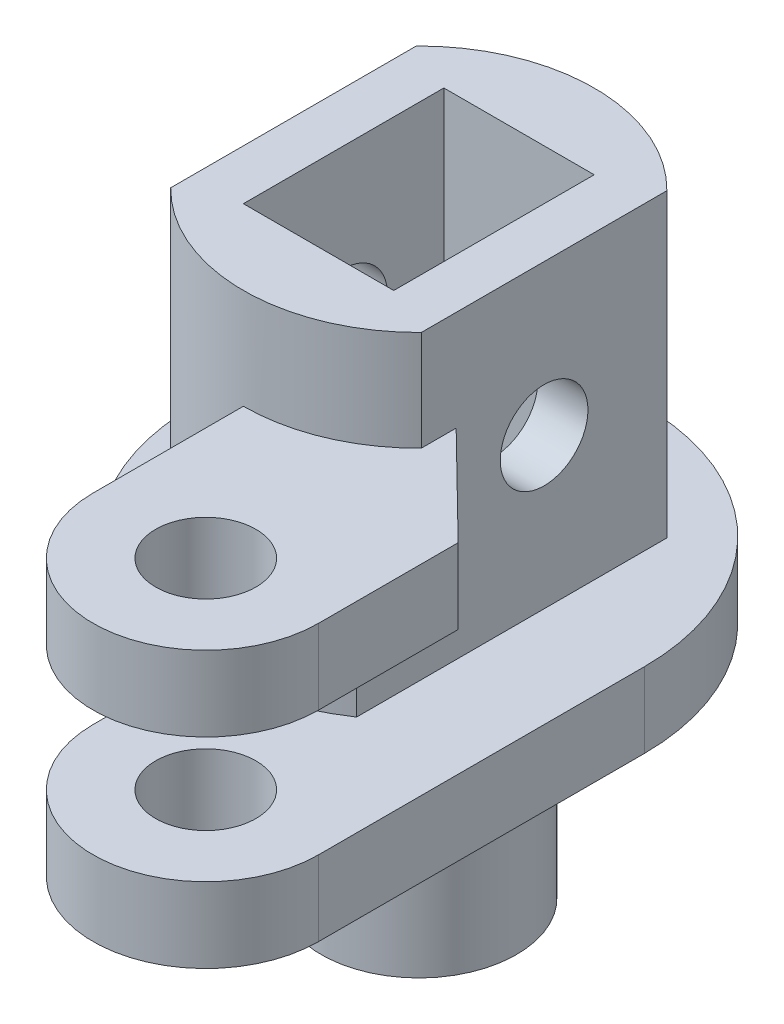
ISO-10303-21;
HEADER;
FILE_DESCRIPTION(('STEP AP214'),'2;1');
FILE_NAME('part.step','',(''),(''),'','','');
FILE_SCHEMA(('AUTOMOTIVE_DESIGN { 1 0 10303 214 1 1 1 1 }'));
ENDSEC;
DATA;
#1=APPLICATION_CONTEXT('core data for automotive mechanical design processes');
#2=APPLICATION_PROTOCOL_DEFINITION('international standard','automotive_design',2000,#1);
#3=PRODUCT_CONTEXT('',#1,'mechanical');
#4=PRODUCT('Part','Part','',(#3));
#5=PRODUCT_RELATED_PRODUCT_CATEGORY('part','',(#4));
#6=PRODUCT_DEFINITION_FORMATION('','',#4);
#7=PRODUCT_DEFINITION_CONTEXT('part definition',#1,'design');
#8=PRODUCT_DEFINITION('design','',#6,#7);
#9=PRODUCT_DEFINITION_SHAPE('','',#8);
#10=(LENGTH_UNIT() NAMED_UNIT(*) SI_UNIT(.MILLI.,.METRE.));
#11=(NAMED_UNIT(*) PLANE_ANGLE_UNIT() SI_UNIT($,.RADIAN.));
#12=(NAMED_UNIT(*) SI_UNIT($,.STERADIAN.) SOLID_ANGLE_UNIT());
#13=UNCERTAINTY_MEASURE_WITH_UNIT(LENGTH_MEASURE(1.E-05),#10,'distance_accuracy_value','');
#14=(GEOMETRIC_REPRESENTATION_CONTEXT(3) GLOBAL_UNCERTAINTY_ASSIGNED_CONTEXT((#13)) GLOBAL_UNIT_ASSIGNED_CONTEXT((#10,
#11,#12)) REPRESENTATION_CONTEXT('',''));
#15=CARTESIAN_POINT('',(0.,0.,0.));
#16=DIRECTION('',(0.,0.,1.));
#17=DIRECTION('',(1.,0.,0.));
#18=AXIS2_PLACEMENT_3D('',#15,#16,#17);
#19=CARTESIAN_POINT('',(0.,15.,0.));
#20=DIRECTION('',(0.,1.,0.));
#21=DIRECTION('',(0.,0.,1.));
#22=AXIS2_PLACEMENT_3D('',#19,#20,#21);
#23=PLANE('',#22);
#24=DIRECTION('',(-1.,0.,0.));
#25=VECTOR('',#24,1.);
#26=CARTESIAN_POINT('',(-3.,15.,-4.));
#27=LINE('',#26,#25);
#28=CARTESIAN_POINT('',(3.,15.,-4.));
#29=VERTEX_POINT('',#28);
#30=CARTESIAN_POINT('',(-3.,15.,-4.));
#31=VERTEX_POINT('',#30);
#32=EDGE_CURVE('E375',#29,#31,#27,.T.);
#33=ORIENTED_EDGE('',*,*,#32,.F.);
#34=DIRECTION('',(0.,0.,-1.));
#35=VECTOR('',#34,1.);
#36=CARTESIAN_POINT('',(3.,15.,-4.));
#37=LINE('',#36,#35);
#38=CARTESIAN_POINT('',(3.,15.,4.));
#39=VERTEX_POINT('',#38);
#40=EDGE_CURVE('E366',#39,#29,#37,.T.);
#41=ORIENTED_EDGE('',*,*,#40,.F.);
#42=DIRECTION('',(1.,0.,0.));
#43=VECTOR('',#42,1.);
#44=CARTESIAN_POINT('',(-3.,15.,4.));
#45=LINE('',#44,#43);
#46=CARTESIAN_POINT('',(-3.,15.,4.));
#47=VERTEX_POINT('',#46);
#48=EDGE_CURVE('E367',#47,#39,#45,.T.);
#49=ORIENTED_EDGE('',*,*,#48,.F.);
#50=DIRECTION('',(0.,0.,1.));
#51=VECTOR('',#50,1.);
#52=CARTESIAN_POINT('',(-3.,15.,-4.));
#53=LINE('',#52,#51);
#54=EDGE_CURVE('E371',#31,#47,#53,.T.);
#55=ORIENTED_EDGE('',*,*,#54,.F.);
#56=EDGE_LOOP('',(#33,#41,#49,#55));
#57=FACE_BOUND('',#56,.T.);
#58=CARTESIAN_POINT('',(0.,15.,0.));
#59=DIRECTION('',(0.,-1.,0.));
#60=DIRECTION('',(0.,0.,1.));
#61=AXIS2_PLACEMENT_3D('',#58,#59,#60);
#62=CIRCLE('',#61,7.);
#63=CARTESIAN_POINT('',(5.,15.,4.89897948556635));
#64=VERTEX_POINT('',#63);
#65=CARTESIAN_POINT('',(-5.00000000000003,15.,4.89897948556632));
#66=VERTEX_POINT('',#65);
#67=EDGE_CURVE('E411',#64,#66,#62,.T.);
#68=ORIENTED_EDGE('',*,*,#67,.F.);
#69=DIRECTION('',(0.,0.,1.));
#70=VECTOR('',#69,1.);
#71=CARTESIAN_POINT('',(5.,15.,9.));
#72=LINE('',#71,#70);
#73=CARTESIAN_POINT('',(5.,15.,-4.89897948556636));
#74=VERTEX_POINT('',#73);
#75=EDGE_CURVE('E195',#74,#64,#72,.T.);
#76=ORIENTED_EDGE('',*,*,#75,.F.);
#77=CARTESIAN_POINT('',(-4.99999999999997,15.,-4.89897948556639));
#78=VERTEX_POINT('',#77);
#79=EDGE_CURVE('E410',#78,#74,#62,.T.);
#80=ORIENTED_EDGE('',*,*,#79,.F.);
#81=DIRECTION('',(0.,0.,-1.));
#82=VECTOR('',#81,1.);
#83=CARTESIAN_POINT('',(-4.99999999999995,15.,-7.50000000000004));
#84=LINE('',#83,#82);
#85=EDGE_CURVE('E70',#66,#78,#84,.T.);
#86=ORIENTED_EDGE('',*,*,#85,.F.);
#87=EDGE_LOOP('',(#68,#76,#80,#86));
#88=FACE_BOUND('',#87,.T.);
#89=ADVANCED_FACE('F45',(#57,#88),#23,.T.);
#90=CARTESIAN_POINT('',(5.,0.,0.));
#91=DIRECTION('',(1.,0.,0.));
#92=DIRECTION('',(0.,0.,-1.));
#93=AXIS2_PLACEMENT_3D('',#90,#91,#92);
#94=PLANE('',#93);
#95=CARTESIAN_POINT('',(5.,9.,0.));
#96=DIRECTION('',(1.,0.,0.));
#97=DIRECTION('',(0.,0.,-1.));
#98=AXIS2_PLACEMENT_3D('',#95,#96,#97);
#99=CIRCLE('',#98,1.75);
#100=CARTESIAN_POINT('',(5.,9.,-1.74999999999997));
#101=VERTEX_POINT('',#100);
#102=EDGE_CURVE('E186',#101,#101,#99,.T.);
#103=ORIENTED_EDGE('',*,*,#102,.F.);
#104=EDGE_LOOP('',(#103));
#105=FACE_BOUND('',#104,.T.);
#106=ORIENTED_EDGE('',*,*,#75,.T.);
#107=DIRECTION('',(0.,1.,0.));
#108=VECTOR('',#107,1.);
#109=CARTESIAN_POINT('',(5.,-14.4558441227157,4.89897948556635));
#110=LINE('',#109,#108);
#111=CARTESIAN_POINT('',(5.,11.,4.89897948556635));
#112=VERTEX_POINT('',#111);
#113=EDGE_CURVE('E180',#64,#112,#110,.F.);
#114=ORIENTED_EDGE('',*,*,#113,.T.);
#115=DIRECTION('',(0.,0.,1.));
#116=VECTOR('',#115,1.);
#117=CARTESIAN_POINT('',(5.,11.,3.50923953039614));
#118=LINE('',#117,#116);
#119=CARTESIAN_POINT('',(5.,11.,3.50923953039614));
#120=VERTEX_POINT('',#119);
#121=EDGE_CURVE('E192',#120,#112,#118,.T.);
#122=ORIENTED_EDGE('',*,*,#121,.F.);
#123=DIRECTION('',(0.,-1.,0.));
#124=VECTOR('',#123,1.);
#125=CARTESIAN_POINT('',(5.,11.,3.50923953039614));
#126=LINE('',#125,#124);
#127=CARTESIAN_POINT('',(5.,8.,3.50923953039614));
#128=VERTEX_POINT('',#127);
#129=EDGE_CURVE('E250',#120,#128,#126,.T.);
#130=ORIENTED_EDGE('',*,*,#129,.T.);
#131=DIRECTION('',(0.,0.,1.));
#132=VECTOR('',#131,1.);
#133=CARTESIAN_POINT('',(5.,8.,3.50923953039614));
#134=LINE('',#133,#132);
#135=CARTESIAN_POINT('',(5.,8.,7.48331477354788));
#136=VERTEX_POINT('',#135);
#137=EDGE_CURVE('E222',#128,#136,#134,.T.);
#138=ORIENTED_EDGE('',*,*,#137,.T.);
#139=DIRECTION('',(0.,-1.,0.));
#140=VECTOR('',#139,1.);
#141=CARTESIAN_POINT('',(5.,15.,7.48331477354788));
#142=LINE('',#141,#140);
#143=CARTESIAN_POINT('',(5.,3.,7.48331477354788));
#144=VERTEX_POINT('',#143);
#145=EDGE_CURVE('E259',#136,#144,#142,.T.);
#146=ORIENTED_EDGE('',*,*,#145,.T.);
#147=DIRECTION('',(0.,0.,-1.));
#148=VECTOR('',#147,1.);
#149=CARTESIAN_POINT('',(5.,3.,9.));
#150=LINE('',#149,#148);
#151=CARTESIAN_POINT('',(5.,3.,-4.89897948556636));
#152=VERTEX_POINT('',#151);
#153=EDGE_CURVE('E253',#144,#152,#150,.T.);
#154=ORIENTED_EDGE('',*,*,#153,.T.);
#155=DIRECTION('',(0.,1.,0.));
#156=VECTOR('',#155,1.);
#157=CARTESIAN_POINT('',(5.,-22.4558441227157,-4.89897948556636));
#158=LINE('',#157,#156);
#159=EDGE_CURVE('E419',#74,#152,#158,.F.);
#160=ORIENTED_EDGE('',*,*,#159,.F.);
#161=EDGE_LOOP('',(#106,#114,#122,#130,#138,#146,#154,#160));
#162=FACE_BOUND('',#161,.T.);
#163=ADVANCED_FACE('F190',(#105,#162),#94,.T.);
#164=CARTESIAN_POINT('',(0.,11.,13.));
#165=DIRECTION('',(1.,0.,0.));
#166=DIRECTION('',(0.,0.,-1.));
#167=AXIS2_PLACEMENT_3D('',#164,#165,#166);
#168=PLANE('',#167);
#169=DIRECTION('',(0.,0.,1.));
#170=VECTOR('',#169,1.);
#171=CARTESIAN_POINT('',(0.,11.,13.));
#172=LINE('',#171,#170);
#173=CARTESIAN_POINT('',(0.,11.,7.));
#174=VERTEX_POINT('',#173);
#175=CARTESIAN_POINT('',(0.,11.,13.));
#176=VERTEX_POINT('',#175);
#177=EDGE_CURVE('E63',#174,#176,#172,.T.);
#178=ORIENTED_EDGE('',*,*,#177,.F.);
#179=DIRECTION('',(0.,1.,0.));
#180=VECTOR('',#179,1.);
#181=CARTESIAN_POINT('',(0.,-22.4558441227157,7.));
#182=LINE('',#181,#180);
#183=CARTESIAN_POINT('',(0.,3.,7.));
#184=VERTEX_POINT('',#183);
#185=EDGE_CURVE('E182',#184,#174,#182,.T.);
#186=ORIENTED_EDGE('',*,*,#185,.F.);
#187=DIRECTION('',(0.,0.,-1.));
#188=VECTOR('',#187,1.);
#189=CARTESIAN_POINT('',(0.,3.,7.));
#190=LINE('',#189,#188);
#191=CARTESIAN_POINT('',(0.,3.,9.));
#192=VERTEX_POINT('',#191);
#193=EDGE_CURVE('E421',#192,#184,#190,.T.);
#194=ORIENTED_EDGE('',*,*,#193,.F.);
#195=DIRECTION('',(0.,1.,0.));
#196=VECTOR('',#195,1.);
#197=CARTESIAN_POINT('',(0.,-22.4558441227157,9.));
#198=LINE('',#197,#196);
#199=CARTESIAN_POINT('',(0.,8.,9.));
#200=VERTEX_POINT('',#199);
#201=EDGE_CURVE('E414',#192,#200,#198,.T.);
#202=ORIENTED_EDGE('',*,*,#201,.T.);
#203=DIRECTION('',(0.,0.,1.));
#204=VECTOR('',#203,1.);
#205=CARTESIAN_POINT('',(0.,8.,13.));
#206=LINE('',#205,#204);
#207=CARTESIAN_POINT('',(0.,8.,13.));
#208=VERTEX_POINT('',#207);
#209=EDGE_CURVE('E231',#200,#208,#206,.T.);
#210=ORIENTED_EDGE('',*,*,#209,.T.);
#211=DIRECTION('',(0.,-1.,0.));
#212=VECTOR('',#211,1.);
#213=CARTESIAN_POINT('',(0.,11.,13.));
#214=LINE('',#213,#212);
#215=EDGE_CURVE('E246',#176,#208,#214,.T.);
#216=ORIENTED_EDGE('',*,*,#215,.F.);
#217=EDGE_LOOP('',(#178,#186,#194,#202,#210,#216));
#218=FACE_BOUND('',#217,.T.);
#219=ADVANCED_FACE('F463',(#218),#168,.F.);
#220=CARTESIAN_POINT('',(0.,-22.4558441227157,0.));
#221=DIRECTION('',(0.,1.,0.));
#222=DIRECTION('',(0.,0.,1.));
#223=AXIS2_PLACEMENT_3D('',#220,#221,#222);
#224=CYLINDRICAL_SURFACE('',#223,7.);
#225=ORIENTED_EDGE('',*,*,#67,.T.);
#226=DIRECTION('',(0.,1.,0.));
#227=VECTOR('',#226,1.);
#228=CARTESIAN_POINT('',(-5.00000000000003,-22.4558441227157,4.89897948556632));
#229=LINE('',#228,#227);
#230=CARTESIAN_POINT('',(-5.00000000000003,3.,4.89897948556632));
#231=VERTEX_POINT('',#230);
#232=EDGE_CURVE('E11',#231,#66,#229,.T.);
#233=ORIENTED_EDGE('',*,*,#232,.F.);
#234=CARTESIAN_POINT('',(0.,3.,0.));
#235=DIRECTION('',(0.,-1.,0.));
#236=DIRECTION('',(0.,0.,-1.));
#237=AXIS2_PLACEMENT_3D('',#234,#235,#236);
#238=CIRCLE('',#237,7.);
#239=EDGE_CURVE('E415',#184,#231,#238,.T.);
#240=ORIENTED_EDGE('',*,*,#239,.F.);
#241=ORIENTED_EDGE('',*,*,#185,.T.);
#242=CARTESIAN_POINT('',(0.,11.,0.));
#243=DIRECTION('',(0.,1.,0.));
#244=DIRECTION('',(0.,0.,1.));
#245=AXIS2_PLACEMENT_3D('',#242,#243,#244);
#246=CIRCLE('',#245,7.);
#247=EDGE_CURVE('E176',#112,#174,#246,.F.);
#248=ORIENTED_EDGE('',*,*,#247,.F.);
#249=ORIENTED_EDGE('',*,*,#113,.F.);
#250=EDGE_LOOP('',(#225,#233,#240,#241,#248,#249));
#251=FACE_BOUND('',#250,.T.);
#252=ADVANCED_FACE('F179',(#251),#224,.T.);
#253=ORIENTED_EDGE('',*,*,#159,.T.);
#254=CARTESIAN_POINT('',(-4.99999999999997,3.,-4.89897948556639));
#255=VERTEX_POINT('',#254);
#256=EDGE_CURVE('E420',#255,#152,#238,.T.);
#257=ORIENTED_EDGE('',*,*,#256,.F.);
#258=DIRECTION('',(0.,1.,0.));
#259=VECTOR('',#258,1.);
#260=CARTESIAN_POINT('',(-4.99999999999997,-22.4558441227157,-4.89897948556639));
#261=LINE('',#260,#259);
#262=EDGE_CURVE('E55',#78,#255,#261,.F.);
#263=ORIENTED_EDGE('',*,*,#262,.F.);
#264=ORIENTED_EDGE('',*,*,#79,.T.);
#265=EDGE_LOOP('',(#253,#257,#263,#264));
#266=FACE_BOUND('',#265,.T.);
#267=ADVANCED_FACE('F592',(#266),#224,.T.);
#268=CARTESIAN_POINT('',(0.,15.,0.));
#269=DIRECTION('',(0.,-1.,0.));
#270=DIRECTION('',(0.,0.,-1.));
#271=AXIS2_PLACEMENT_3D('',#268,#269,#270);
#272=CYLINDRICAL_SURFACE('',#271,9.);
#273=DIRECTION('',(0.,-1.,0.));
#274=VECTOR('',#273,1.);
#275=CARTESIAN_POINT('',(0.,3.,9.));
#276=LINE('',#275,#274);
#277=CARTESIAN_POINT('',(0.,0.,9.));
#278=VERTEX_POINT('',#277);
#279=EDGE_CURVE('E301',#192,#278,#276,.T.);
#280=ORIENTED_EDGE('',*,*,#279,.F.);
#281=CARTESIAN_POINT('',(0.,3.,0.));
#282=DIRECTION('',(0.,1.,0.));
#283=DIRECTION('',(0.,0.,1.));
#284=AXIS2_PLACEMENT_3D('',#281,#282,#283);
#285=CIRCLE('',#284,9.);
#286=CARTESIAN_POINT('',(9.,3.,0.));
#287=VERTEX_POINT('',#286);
#288=EDGE_CURVE('E262',#287,#192,#285,.T.);
#289=ORIENTED_EDGE('',*,*,#288,.F.);
#290=DIRECTION('',(0.,-1.,0.));
#291=VECTOR('',#290,1.);
#292=CARTESIAN_POINT('',(9.,3.,0.));
#293=LINE('',#292,#291);
#294=CARTESIAN_POINT('',(9.,0.,0.));
#295=VERTEX_POINT('',#294);
#296=EDGE_CURVE('E290',#287,#295,#293,.T.);
#297=ORIENTED_EDGE('',*,*,#296,.T.);
#298=CARTESIAN_POINT('',(0.,0.,0.));
#299=DIRECTION('',(0.,1.,0.));
#300=DIRECTION('',(0.,0.,1.));
#301=AXIS2_PLACEMENT_3D('',#298,#299,#300);
#302=CIRCLE('',#301,9.);
#303=EDGE_CURVE('E327',#295,#278,#302,.T.);
#304=ORIENTED_EDGE('',*,*,#303,.T.);
#305=EDGE_LOOP('',(#280,#289,#297,#304));
#306=FACE_BOUND('',#305,.T.);
#307=ADVANCED_FACE('F480',(#306),#272,.T.);
#308=CARTESIAN_POINT('',(0.,8.,0.));
#309=DIRECTION('',(0.,-1.,0.));
#310=DIRECTION('',(0.,0.,1.));
#311=AXIS2_PLACEMENT_3D('',#308,#309,#310);
#312=CIRCLE('',#311,9.);
#313=EDGE_CURVE('E227',#136,#200,#312,.T.);
#314=ORIENTED_EDGE('',*,*,#313,.T.);
#315=ORIENTED_EDGE('',*,*,#201,.F.);
#316=CARTESIAN_POINT('',(0.,3.,0.));
#317=DIRECTION('',(0.,1.,0.));
#318=DIRECTION('',(0.,0.,-1.));
#319=AXIS2_PLACEMENT_3D('',#316,#317,#318);
#320=CIRCLE('',#319,9.);
#321=EDGE_CURVE('E274',#192,#144,#320,.T.);
#322=ORIENTED_EDGE('',*,*,#321,.T.);
#323=ORIENTED_EDGE('',*,*,#145,.F.);
#324=EDGE_LOOP('',(#314,#315,#322,#323));
#325=FACE_BOUND('',#324,.T.);
#326=ADVANCED_FACE('F47',(#325),#272,.T.);
#327=CARTESIAN_POINT('',(0.,0.,0.));
#328=DIRECTION('',(0.,1.,0.));
#329=DIRECTION('',(0.,0.,1.));
#330=AXIS2_PLACEMENT_3D('',#327,#328,#329);
#331=PLANE('',#330);
#332=CARTESIAN_POINT('',(0.,0.,0.));
#333=DIRECTION('',(0.,-1.,0.));
#334=DIRECTION('',(0.,0.,-1.));
#335=AXIS2_PLACEMENT_3D('',#332,#333,#334);
#336=CIRCLE('',#335,6.4);
#337=CARTESIAN_POINT('',(0.,0.,-6.4));
#338=VERTEX_POINT('',#337);
#339=EDGE_CURVE('E323',#338,#338,#336,.T.);
#340=ORIENTED_EDGE('',*,*,#339,.F.);
#341=EDGE_LOOP('',(#340));
#342=FACE_BOUND('',#341,.T.);
#343=ORIENTED_EDGE('',*,*,#303,.F.);
#344=DIRECTION('',(0.,0.,1.));
#345=VECTOR('',#344,1.);
#346=CARTESIAN_POINT('',(9.,0.,0.));
#347=LINE('',#346,#345);
#348=CARTESIAN_POINT('',(8.99999999999999,0.,13.));
#349=VERTEX_POINT('',#348);
#350=EDGE_CURVE('E270',#295,#349,#347,.T.);
#351=ORIENTED_EDGE('',*,*,#350,.T.);
#352=CARTESIAN_POINT('',(4.5,0.,13.));
#353=DIRECTION('',(0.,-1.,0.));
#354=DIRECTION('',(0.,0.,-1.));
#355=AXIS2_PLACEMENT_3D('',#352,#353,#354);
#356=CIRCLE('',#355,4.5);
#357=CARTESIAN_POINT('',(0.,0.,13.));
#358=VERTEX_POINT('',#357);
#359=EDGE_CURVE('E294',#349,#358,#356,.T.);
#360=ORIENTED_EDGE('',*,*,#359,.T.);
#361=DIRECTION('',(0.,0.,-1.));
#362=VECTOR('',#361,1.);
#363=CARTESIAN_POINT('',(0.,0.,9.));
#364=LINE('',#363,#362);
#365=EDGE_CURVE('E279',#358,#278,#364,.T.);
#366=ORIENTED_EDGE('',*,*,#365,.T.);
#367=EDGE_LOOP('',(#343,#351,#360,#366));
#368=FACE_BOUND('',#367,.T.);
#369=CARTESIAN_POINT('',(4.5,0.,13.));
#370=DIRECTION('',(0.,-1.,0.));
#371=DIRECTION('',(0.,0.,-1.));
#372=AXIS2_PLACEMENT_3D('',#369,#370,#371);
#373=CIRCLE('',#372,2.);
#374=CARTESIAN_POINT('',(4.5,0.,11.));
#375=VERTEX_POINT('',#374);
#376=EDGE_CURVE('E265',#375,#375,#373,.T.);
#377=ORIENTED_EDGE('',*,*,#376,.F.);
#378=EDGE_LOOP('',(#377));
#379=FACE_BOUND('',#378,.T.);
#380=ADVANCED_FACE('F471',(#342,#368,#379),#331,.F.);
#381=CARTESIAN_POINT('',(0.,-2.5,0.));
#382=DIRECTION('',(0.,1.,0.));
#383=DIRECTION('',(0.,0.,1.));
#384=AXIS2_PLACEMENT_3D('',#381,#382,#383);
#385=CYLINDRICAL_SURFACE('',#384,6.4);
#386=CARTESIAN_POINT('',(0.,-2.5,0.));
#387=DIRECTION('',(0.,-1.,0.));
#388=DIRECTION('',(0.,0.,-1.));
#389=AXIS2_PLACEMENT_3D('',#386,#387,#388);
#390=CIRCLE('',#389,6.4);
#391=CARTESIAN_POINT('',(0.,-2.5,-6.4));
#392=VERTEX_POINT('',#391);
#393=EDGE_CURVE('E318',#392,#392,#390,.T.);
#394=ORIENTED_EDGE('',*,*,#393,.F.);
#395=EDGE_LOOP('',(#394));
#396=FACE_BOUND('',#395,.T.);
#397=ORIENTED_EDGE('',*,*,#339,.T.);
#398=EDGE_LOOP('',(#397));
#399=FACE_BOUND('',#398,.T.);
#400=ADVANCED_FACE('F469',(#396,#399),#385,.T.);
#401=CARTESIAN_POINT('',(0.,-2.5,0.));
#402=DIRECTION('',(0.,-1.,0.));
#403=DIRECTION('',(0.,0.,-1.));
#404=AXIS2_PLACEMENT_3D('',#401,#402,#403);
#405=PLANE('',#404);
#406=CARTESIAN_POINT('',(0.,-2.5,0.));
#407=DIRECTION('',(0.,-1.,0.));
#408=DIRECTION('',(0.,0.,-1.));
#409=AXIS2_PLACEMENT_3D('',#406,#407,#408);
#410=CIRCLE('',#409,3.9);
#411=CARTESIAN_POINT('',(0.,-2.5,-3.9));
#412=VERTEX_POINT('',#411);
#413=EDGE_CURVE('E319',#412,#412,#410,.T.);
#414=ORIENTED_EDGE('',*,*,#413,.F.);
#415=EDGE_LOOP('',(#414));
#416=FACE_BOUND('',#415,.T.);
#417=ORIENTED_EDGE('',*,*,#393,.T.);
#418=EDGE_LOOP('',(#417));
#419=FACE_BOUND('',#418,.T.);
#420=ADVANCED_FACE('F478',(#416,#419),#405,.T.);
#421=CARTESIAN_POINT('',(0.,-9.5,0.));
#422=DIRECTION('',(0.,1.,0.));
#423=DIRECTION('',(0.,0.,1.));
#424=AXIS2_PLACEMENT_3D('',#421,#422,#423);
#425=CYLINDRICAL_SURFACE('',#424,3.9);
#426=CARTESIAN_POINT('',(0.,-9.5,0.));
#427=DIRECTION('',(0.,-1.,0.));
#428=DIRECTION('',(0.,0.,-1.));
#429=AXIS2_PLACEMENT_3D('',#426,#427,#428);
#430=CIRCLE('',#429,3.9);
#431=CARTESIAN_POINT('',(0.,-9.5,-3.9));
#432=VERTEX_POINT('',#431);
#433=EDGE_CURVE('E305',#432,#432,#430,.T.);
#434=ORIENTED_EDGE('',*,*,#433,.F.);
#435=EDGE_LOOP('',(#434));
#436=FACE_BOUND('',#435,.T.);
#437=ORIENTED_EDGE('',*,*,#413,.T.);
#438=EDGE_LOOP('',(#437));
#439=FACE_BOUND('',#438,.T.);
#440=ADVANCED_FACE('F516',(#436,#439),#425,.T.);
#441=CARTESIAN_POINT('',(0.,-9.5,0.));
#442=DIRECTION('',(0.,-1.,0.));
#443=DIRECTION('',(0.,0.,-1.));
#444=AXIS2_PLACEMENT_3D('',#441,#442,#443);
#445=PLANE('',#444);
#446=CARTESIAN_POINT('',(0.,-9.5,0.));
#447=DIRECTION('',(0.,1.,0.));
#448=DIRECTION('',(0.,0.,1.));
#449=AXIS2_PLACEMENT_3D('',#446,#447,#448);
#450=CIRCLE('',#449,1.65);
#451=CARTESIAN_POINT('',(0.,-9.5,1.65));
#452=VERTEX_POINT('',#451);
#453=EDGE_CURVE('E346',#452,#452,#450,.T.);
#454=ORIENTED_EDGE('',*,*,#453,.T.);
#455=EDGE_LOOP('',(#454));
#456=FACE_BOUND('',#455,.T.);
#457=ORIENTED_EDGE('',*,*,#433,.T.);
#458=EDGE_LOOP('',(#457));
#459=FACE_BOUND('',#458,.T.);
#460=ADVANCED_FACE('F506',(#456,#459),#445,.T.);
#461=CARTESIAN_POINT('',(0.,3.,9.));
#462=DIRECTION('',(-1.,0.,0.));
#463=DIRECTION('',(0.,0.,1.));
#464=AXIS2_PLACEMENT_3D('',#461,#462,#463);
#465=PLANE('',#464);
#466=ORIENTED_EDGE('',*,*,#365,.F.);
#467=DIRECTION('',(0.,-1.,0.));
#468=VECTOR('',#467,1.);
#469=CARTESIAN_POINT('',(0.,3.,13.));
#470=LINE('',#469,#468);
#471=CARTESIAN_POINT('',(0.,3.,13.));
#472=VERTEX_POINT('',#471);
#473=EDGE_CURVE('E306',#472,#358,#470,.T.);
#474=ORIENTED_EDGE('',*,*,#473,.F.);
#475=DIRECTION('',(0.,0.,-1.));
#476=VECTOR('',#475,1.);
#477=CARTESIAN_POINT('',(0.,3.,9.));
#478=LINE('',#477,#476);
#479=EDGE_CURVE('E286',#472,#192,#478,.T.);
#480=ORIENTED_EDGE('',*,*,#479,.T.);
#481=ORIENTED_EDGE('',*,*,#279,.T.);
#482=EDGE_LOOP('',(#466,#474,#480,#481));
#483=FACE_BOUND('',#482,.T.);
#484=ADVANCED_FACE('F502',(#483),#465,.T.);
#485=CARTESIAN_POINT('',(4.5,3.,13.));
#486=DIRECTION('',(0.,-1.,0.));
#487=DIRECTION('',(0.,0.,-1.));
#488=AXIS2_PLACEMENT_3D('',#485,#486,#487);
#489=CYLINDRICAL_SURFACE('',#488,4.5);
#490=ORIENTED_EDGE('',*,*,#359,.F.);
#491=DIRECTION('',(0.,-1.,0.));
#492=VECTOR('',#491,1.);
#493=CARTESIAN_POINT('',(8.99999999999999,3.,13.));
#494=LINE('',#493,#492);
#495=CARTESIAN_POINT('',(8.99999999999999,3.,13.));
#496=VERTEX_POINT('',#495);
#497=EDGE_CURVE('E309',#496,#349,#494,.T.);
#498=ORIENTED_EDGE('',*,*,#497,.F.);
#499=CARTESIAN_POINT('',(4.5,3.,13.));
#500=DIRECTION('',(0.,-1.,0.));
#501=DIRECTION('',(0.,0.,-1.));
#502=AXIS2_PLACEMENT_3D('',#499,#500,#501);
#503=CIRCLE('',#502,4.5);
#504=EDGE_CURVE('E282',#496,#472,#503,.T.);
#505=ORIENTED_EDGE('',*,*,#504,.T.);
#506=ORIENTED_EDGE('',*,*,#473,.T.);
#507=EDGE_LOOP('',(#490,#498,#505,#506));
#508=FACE_BOUND('',#507,.T.);
#509=ADVANCED_FACE('F505',(#508),#489,.T.);
#510=CARTESIAN_POINT('',(9.,3.,0.));
#511=DIRECTION('',(1.,0.,0.));
#512=DIRECTION('',(0.,0.,-1.));
#513=AXIS2_PLACEMENT_3D('',#510,#511,#512);
#514=PLANE('',#513);
#515=ORIENTED_EDGE('',*,*,#350,.F.);
#516=ORIENTED_EDGE('',*,*,#296,.F.);
#517=DIRECTION('',(0.,0.,1.));
#518=VECTOR('',#517,1.);
#519=CARTESIAN_POINT('',(9.,3.,0.));
#520=LINE('',#519,#518);
#521=EDGE_CURVE('E278',#287,#496,#520,.T.);
#522=ORIENTED_EDGE('',*,*,#521,.T.);
#523=ORIENTED_EDGE('',*,*,#497,.T.);
#524=EDGE_LOOP('',(#515,#516,#522,#523));
#525=FACE_BOUND('',#524,.T.);
#526=ADVANCED_FACE('F496',(#525),#514,.T.);
#527=CARTESIAN_POINT('',(0.,3.,0.));
#528=DIRECTION('',(0.,-1.,0.));
#529=DIRECTION('',(0.,0.,-1.));
#530=AXIS2_PLACEMENT_3D('',#527,#528,#529);
#531=PLANE('',#530);
#532=ORIENTED_EDGE('',*,*,#288,.T.);
#533=ORIENTED_EDGE('',*,*,#193,.T.);
#534=ORIENTED_EDGE('',*,*,#239,.T.);
#535=DIRECTION('',(0.,0.,1.));
#536=VECTOR('',#535,1.);
#537=CARTESIAN_POINT('',(-4.99999999999995,3.,-7.50000000000004));
#538=LINE('',#537,#536);
#539=EDGE_CURVE('E363',#255,#231,#538,.T.);
#540=ORIENTED_EDGE('',*,*,#539,.F.);
#541=ORIENTED_EDGE('',*,*,#256,.T.);
#542=ORIENTED_EDGE('',*,*,#153,.F.);
#543=ORIENTED_EDGE('',*,*,#321,.F.);
#544=ORIENTED_EDGE('',*,*,#479,.F.);
#545=ORIENTED_EDGE('',*,*,#504,.F.);
#546=ORIENTED_EDGE('',*,*,#521,.F.);
#547=EDGE_LOOP('',(#532,#533,#534,#540,#541,#542,#543,#544,#545,#546));
#548=FACE_BOUND('',#547,.T.);
#549=CARTESIAN_POINT('',(4.5,3.,13.));
#550=DIRECTION('',(0.,-1.,0.));
#551=DIRECTION('',(0.,0.,-1.));
#552=AXIS2_PLACEMENT_3D('',#549,#550,#551);
#553=CIRCLE('',#552,2.);
#554=CARTESIAN_POINT('',(4.5,3.,11.));
#555=VERTEX_POINT('',#554);
#556=EDGE_CURVE('E266',#555,#555,#553,.T.);
#557=ORIENTED_EDGE('',*,*,#556,.T.);
#558=EDGE_LOOP('',(#557));
#559=FACE_BOUND('',#558,.T.);
#560=ADVANCED_FACE('F489',(#548,#559),#531,.F.);
#561=CARTESIAN_POINT('',(4.5,3.,13.));
#562=DIRECTION('',(0.,-1.,0.));
#563=DIRECTION('',(0.,0.,-1.));
#564=AXIS2_PLACEMENT_3D('',#561,#562,#563);
#565=CYLINDRICAL_SURFACE('',#564,2.);
#566=ORIENTED_EDGE('',*,*,#556,.F.);
#567=EDGE_LOOP('',(#566));
#568=FACE_BOUND('',#567,.T.);
#569=ORIENTED_EDGE('',*,*,#376,.T.);
#570=EDGE_LOOP('',(#569));
#571=FACE_BOUND('',#570,.T.);
#572=ADVANCED_FACE('F487',(#568,#571),#565,.F.);
#573=CARTESIAN_POINT('',(0.,11.,0.));
#574=DIRECTION('',(0.,1.,0.));
#575=DIRECTION('',(0.,0.,1.));
#576=AXIS2_PLACEMENT_3D('',#573,#574,#575);
#577=PLANE('',#576);
#578=DIRECTION('',(-0.714212839142511,0.,-0.699928582359653));
#579=VECTOR('',#578,1.);
#580=CARTESIAN_POINT('',(9.,11.,7.42923953039609));
#581=LINE('',#580,#579);
#582=CARTESIAN_POINT('',(9.,11.,7.42923953039609));
#583=VERTEX_POINT('',#582);
#584=EDGE_CURVE('E201',#583,#120,#581,.T.);
#585=ORIENTED_EDGE('',*,*,#584,.T.);
#586=ORIENTED_EDGE('',*,*,#121,.T.);
#587=ORIENTED_EDGE('',*,*,#247,.T.);
#588=ORIENTED_EDGE('',*,*,#177,.T.);
#589=CARTESIAN_POINT('',(4.5,11.,13.));
#590=DIRECTION('',(0.,1.,0.));
#591=DIRECTION('',(0.,0.,1.));
#592=AXIS2_PLACEMENT_3D('',#589,#590,#591);
#593=CIRCLE('',#592,4.5);
#594=CARTESIAN_POINT('',(8.99999999999999,11.,13.));
#595=VERTEX_POINT('',#594);
#596=EDGE_CURVE('E207',#176,#595,#593,.T.);
#597=ORIENTED_EDGE('',*,*,#596,.T.);
#598=DIRECTION('',(0.,0.,-1.));
#599=VECTOR('',#598,1.);
#600=CARTESIAN_POINT('',(8.99999999999999,11.,13.));
#601=LINE('',#600,#599);
#602=EDGE_CURVE('E215',#595,#583,#601,.T.);
#603=ORIENTED_EDGE('',*,*,#602,.T.);
#604=EDGE_LOOP('',(#585,#586,#587,#588,#597,#603));
#605=FACE_BOUND('',#604,.T.);
#606=CARTESIAN_POINT('',(4.5,11.,13.));
#607=DIRECTION('',(0.,1.,0.));
#608=DIRECTION('',(0.,0.,1.));
#609=AXIS2_PLACEMENT_3D('',#606,#607,#608);
#610=CIRCLE('',#609,2.);
#611=CARTESIAN_POINT('',(4.5,11.,15.));
#612=VERTEX_POINT('',#611);
#613=EDGE_CURVE('E223',#612,#612,#610,.T.);
#614=ORIENTED_EDGE('',*,*,#613,.F.);
#615=EDGE_LOOP('',(#614));
#616=FACE_BOUND('',#615,.T.);
#617=ADVANCED_FACE('F198',(#605,#616),#577,.T.);
#618=CARTESIAN_POINT('',(0.,8.,0.));
#619=DIRECTION('',(0.,1.,0.));
#620=DIRECTION('',(0.,0.,1.));
#621=AXIS2_PLACEMENT_3D('',#618,#619,#620);
#622=PLANE('',#621);
#623=DIRECTION('',(-0.714212839142511,0.,-0.699928582359653));
#624=VECTOR('',#623,1.);
#625=CARTESIAN_POINT('',(9.,8.,7.42923953039609));
#626=LINE('',#625,#624);
#627=CARTESIAN_POINT('',(9.,8.,7.42923953039609));
#628=VERTEX_POINT('',#627);
#629=EDGE_CURVE('E219',#628,#128,#626,.T.);
#630=ORIENTED_EDGE('',*,*,#629,.F.);
#631=DIRECTION('',(0.,0.,-1.));
#632=VECTOR('',#631,1.);
#633=CARTESIAN_POINT('',(8.99999999999999,8.,13.));
#634=LINE('',#633,#632);
#635=CARTESIAN_POINT('',(8.99999999999999,8.,13.));
#636=VERTEX_POINT('',#635);
#637=EDGE_CURVE('E209',#636,#628,#634,.T.);
#638=ORIENTED_EDGE('',*,*,#637,.F.);
#639=CARTESIAN_POINT('',(4.5,8.,13.));
#640=DIRECTION('',(0.,1.,0.));
#641=DIRECTION('',(0.,0.,1.));
#642=AXIS2_PLACEMENT_3D('',#639,#640,#641);
#643=CIRCLE('',#642,4.5);
#644=EDGE_CURVE('E234',#208,#636,#643,.T.);
#645=ORIENTED_EDGE('',*,*,#644,.F.);
#646=ORIENTED_EDGE('',*,*,#209,.F.);
#647=ORIENTED_EDGE('',*,*,#313,.F.);
#648=ORIENTED_EDGE('',*,*,#137,.F.);
#649=EDGE_LOOP('',(#630,#638,#645,#646,#647,#648));
#650=FACE_BOUND('',#649,.T.);
#651=CARTESIAN_POINT('',(4.5,8.,13.));
#652=DIRECTION('',(0.,1.,0.));
#653=DIRECTION('',(0.,0.,1.));
#654=AXIS2_PLACEMENT_3D('',#651,#652,#653);
#655=CIRCLE('',#654,2.);
#656=CARTESIAN_POINT('',(4.5,8.,15.));
#657=VERTEX_POINT('',#656);
#658=EDGE_CURVE('E431',#657,#657,#655,.T.);
#659=ORIENTED_EDGE('',*,*,#658,.T.);
#660=EDGE_LOOP('',(#659));
#661=FACE_BOUND('',#660,.T.);
#662=ADVANCED_FACE('F438',(#650,#661),#622,.F.);
#663=CARTESIAN_POINT('',(9.,11.,7.42923953039609));
#664=DIRECTION('',(-0.699928582359653,0.,0.714212839142511));
#665=DIRECTION('',(0.714212839142511,0.,0.699928582359653));
#666=AXIS2_PLACEMENT_3D('',#663,#664,#665);
#667=PLANE('',#666);
#668=ORIENTED_EDGE('',*,*,#129,.F.);
#669=ORIENTED_EDGE('',*,*,#584,.F.);
#670=DIRECTION('',(0.,-1.,0.));
#671=VECTOR('',#670,1.);
#672=CARTESIAN_POINT('',(9.,11.,7.42923953039609));
#673=LINE('',#672,#671);
#674=EDGE_CURVE('E218',#583,#628,#673,.T.);
#675=ORIENTED_EDGE('',*,*,#674,.T.);
#676=ORIENTED_EDGE('',*,*,#629,.T.);
#677=EDGE_LOOP('',(#668,#669,#675,#676));
#678=FACE_BOUND('',#677,.T.);
#679=ADVANCED_FACE('F615',(#678),#667,.F.);
#680=CARTESIAN_POINT('',(4.5,11.,13.));
#681=DIRECTION('',(0.,-1.,0.));
#682=DIRECTION('',(0.,0.,-1.));
#683=AXIS2_PLACEMENT_3D('',#680,#681,#682);
#684=CYLINDRICAL_SURFACE('',#683,4.5);
#685=ORIENTED_EDGE('',*,*,#644,.T.);
#686=DIRECTION('',(0.,-1.,0.));
#687=VECTOR('',#686,1.);
#688=CARTESIAN_POINT('',(8.99999999999999,11.,13.));
#689=LINE('',#688,#687);
#690=EDGE_CURVE('E242',#595,#636,#689,.T.);
#691=ORIENTED_EDGE('',*,*,#690,.F.);
#692=ORIENTED_EDGE('',*,*,#596,.F.);
#693=ORIENTED_EDGE('',*,*,#215,.T.);
#694=EDGE_LOOP('',(#685,#691,#692,#693));
#695=FACE_BOUND('',#694,.T.);
#696=ADVANCED_FACE('F452',(#695),#684,.T.);
#697=CARTESIAN_POINT('',(8.99999999999999,11.,13.));
#698=DIRECTION('',(-1.,0.,0.));
#699=DIRECTION('',(0.,0.,1.));
#700=AXIS2_PLACEMENT_3D('',#697,#698,#699);
#701=PLANE('',#700);
#702=ORIENTED_EDGE('',*,*,#637,.T.);
#703=ORIENTED_EDGE('',*,*,#674,.F.);
#704=ORIENTED_EDGE('',*,*,#602,.F.);
#705=ORIENTED_EDGE('',*,*,#690,.T.);
#706=EDGE_LOOP('',(#702,#703,#704,#705));
#707=FACE_BOUND('',#706,.T.);
#708=ADVANCED_FACE('F443',(#707),#701,.F.);
#709=CARTESIAN_POINT('',(4.5,11.,13.));
#710=DIRECTION('',(0.,-1.,0.));
#711=DIRECTION('',(0.,0.,-1.));
#712=AXIS2_PLACEMENT_3D('',#709,#710,#711);
#713=CYLINDRICAL_SURFACE('',#712,2.);
#714=ORIENTED_EDGE('',*,*,#613,.T.);
#715=EDGE_LOOP('',(#714));
#716=FACE_BOUND('',#715,.T.);
#717=ORIENTED_EDGE('',*,*,#658,.F.);
#718=EDGE_LOOP('',(#717));
#719=FACE_BOUND('',#718,.T.);
#720=ADVANCED_FACE('F440',(#716,#719),#713,.F.);
#721=CARTESIAN_POINT('',(0.,3.,0.));
#722=DIRECTION('',(0.,-1.,0.));
#723=DIRECTION('',(0.,0.,-1.));
#724=AXIS2_PLACEMENT_3D('',#721,#722,#723);
#725=PLANE('',#724);
#726=CARTESIAN_POINT('',(0.,3.,0.));
#727=DIRECTION('',(0.,-1.,0.));
#728=DIRECTION('',(0.,0.,-1.));
#729=AXIS2_PLACEMENT_3D('',#726,#727,#728);
#730=CIRCLE('',#729,1.65);
#731=CARTESIAN_POINT('',(0.,3.,-1.65));
#732=VERTEX_POINT('',#731);
#733=EDGE_CURVE('E49',#732,#732,#730,.T.);
#734=ORIENTED_EDGE('',*,*,#733,.T.);
#735=EDGE_LOOP('',(#734));
#736=FACE_BOUND('',#735,.T.);
#737=DIRECTION('',(0.,0.,-1.));
#738=VECTOR('',#737,1.);
#739=CARTESIAN_POINT('',(3.,3.,-4.));
#740=LINE('',#739,#738);
#741=CARTESIAN_POINT('',(3.,3.,4.));
#742=VERTEX_POINT('',#741);
#743=CARTESIAN_POINT('',(3.,3.,-4.));
#744=VERTEX_POINT('',#743);
#745=EDGE_CURVE('E386',#742,#744,#740,.T.);
#746=ORIENTED_EDGE('',*,*,#745,.T.);
#747=DIRECTION('',(-1.,0.,0.));
#748=VECTOR('',#747,1.);
#749=CARTESIAN_POINT('',(-3.,3.,-4.));
#750=LINE('',#749,#748);
#751=CARTESIAN_POINT('',(-3.,3.,-4.));
#752=VERTEX_POINT('',#751);
#753=EDGE_CURVE('E370',#744,#752,#750,.T.);
#754=ORIENTED_EDGE('',*,*,#753,.T.);
#755=DIRECTION('',(0.,0.,1.));
#756=VECTOR('',#755,1.);
#757=CARTESIAN_POINT('',(-3.,3.,-4.));
#758=LINE('',#757,#756);
#759=CARTESIAN_POINT('',(-3.,3.,4.));
#760=VERTEX_POINT('',#759);
#761=EDGE_CURVE('E397',#752,#760,#758,.T.);
#762=ORIENTED_EDGE('',*,*,#761,.T.);
#763=DIRECTION('',(1.,0.,0.));
#764=VECTOR('',#763,1.);
#765=CARTESIAN_POINT('',(-3.,3.,4.));
#766=LINE('',#765,#764);
#767=EDGE_CURVE('E392',#760,#742,#766,.T.);
#768=ORIENTED_EDGE('',*,*,#767,.T.);
#769=EDGE_LOOP('',(#746,#754,#762,#768));
#770=FACE_BOUND('',#769,.T.);
#771=ADVANCED_FACE('F442',(#736,#770),#725,.F.);
#772=CARTESIAN_POINT('',(-3.,-7.,-4.));
#773=DIRECTION('',(0.,0.,-1.));
#774=DIRECTION('',(-1.,0.,0.));
#775=AXIS2_PLACEMENT_3D('',#772,#773,#774);
#776=PLANE('',#775);
#777=DIRECTION('',(0.,1.,0.));
#778=VECTOR('',#777,1.);
#779=CARTESIAN_POINT('',(3.,-7.,-4.));
#780=LINE('',#779,#778);
#781=EDGE_CURVE('E390',#744,#29,#780,.T.);
#782=ORIENTED_EDGE('',*,*,#781,.T.);
#783=ORIENTED_EDGE('',*,*,#32,.T.);
#784=DIRECTION('',(0.,1.,0.));
#785=VECTOR('',#784,1.);
#786=CARTESIAN_POINT('',(-3.,-7.,-4.));
#787=LINE('',#786,#785);
#788=EDGE_CURVE('E385',#752,#31,#787,.T.);
#789=ORIENTED_EDGE('',*,*,#788,.F.);
#790=ORIENTED_EDGE('',*,*,#753,.F.);
#791=EDGE_LOOP('',(#782,#783,#789,#790));
#792=FACE_BOUND('',#791,.T.);
#793=ADVANCED_FACE('F450',(#792),#776,.F.);
#794=CARTESIAN_POINT('',(-3.,-7.,-4.));
#795=DIRECTION('',(-1.,0.,0.));
#796=DIRECTION('',(0.,0.,1.));
#797=AXIS2_PLACEMENT_3D('',#794,#795,#796);
#798=PLANE('',#797);
#799=CARTESIAN_POINT('',(-3.,9.,0.));
#800=DIRECTION('',(-1.,0.,0.));
#801=DIRECTION('',(0.,0.,1.));
#802=AXIS2_PLACEMENT_3D('',#799,#800,#801);
#803=CIRCLE('',#802,1.75);
#804=CARTESIAN_POINT('',(-3.,9.,1.74999999999998));
#805=VERTEX_POINT('',#804);
#806=EDGE_CURVE('E343',#805,#805,#803,.T.);
#807=ORIENTED_EDGE('',*,*,#806,.T.);
#808=EDGE_LOOP('',(#807));
#809=FACE_BOUND('',#808,.T.);
#810=ORIENTED_EDGE('',*,*,#788,.T.);
#811=ORIENTED_EDGE('',*,*,#54,.T.);
#812=DIRECTION('',(0.,1.,0.));
#813=VECTOR('',#812,1.);
#814=CARTESIAN_POINT('',(-3.,-7.,4.));
#815=LINE('',#814,#813);
#816=EDGE_CURVE('E396',#760,#47,#815,.T.);
#817=ORIENTED_EDGE('',*,*,#816,.F.);
#818=ORIENTED_EDGE('',*,*,#761,.F.);
#819=EDGE_LOOP('',(#810,#811,#817,#818));
#820=FACE_BOUND('',#819,.T.);
#821=ADVANCED_FACE('F632',(#809,#820),#798,.F.);
#822=CARTESIAN_POINT('',(-3.,-7.,4.));
#823=DIRECTION('',(0.,0.,1.));
#824=DIRECTION('',(1.,0.,0.));
#825=AXIS2_PLACEMENT_3D('',#822,#823,#824);
#826=PLANE('',#825);
#827=ORIENTED_EDGE('',*,*,#816,.T.);
#828=ORIENTED_EDGE('',*,*,#48,.T.);
#829=DIRECTION('',(0.,1.,0.));
#830=VECTOR('',#829,1.);
#831=CARTESIAN_POINT('',(3.,-7.,4.));
#832=LINE('',#831,#830);
#833=EDGE_CURVE('E391',#742,#39,#832,.T.);
#834=ORIENTED_EDGE('',*,*,#833,.F.);
#835=ORIENTED_EDGE('',*,*,#767,.F.);
#836=EDGE_LOOP('',(#827,#828,#834,#835));
#837=FACE_BOUND('',#836,.T.);
#838=ADVANCED_FACE('F637',(#837),#826,.F.);
#839=CARTESIAN_POINT('',(3.,-7.,-4.));
#840=DIRECTION('',(1.,0.,0.));
#841=DIRECTION('',(0.,0.,-1.));
#842=AXIS2_PLACEMENT_3D('',#839,#840,#841);
#843=PLANE('',#842);
#844=CARTESIAN_POINT('',(3.,9.,0.));
#845=DIRECTION('',(1.,0.,0.));
#846=DIRECTION('',(0.,0.,-1.));
#847=AXIS2_PLACEMENT_3D('',#844,#845,#846);
#848=CIRCLE('',#847,1.75);
#849=CARTESIAN_POINT('',(3.,9.,-1.74999999999998));
#850=VERTEX_POINT('',#849);
#851=EDGE_CURVE('E337',#850,#850,#848,.T.);
#852=ORIENTED_EDGE('',*,*,#851,.T.);
#853=EDGE_LOOP('',(#852));
#854=FACE_BOUND('',#853,.T.);
#855=ORIENTED_EDGE('',*,*,#833,.T.);
#856=ORIENTED_EDGE('',*,*,#40,.T.);
#857=ORIENTED_EDGE('',*,*,#781,.F.);
#858=ORIENTED_EDGE('',*,*,#745,.F.);
#859=EDGE_LOOP('',(#855,#856,#857,#858));
#860=FACE_BOUND('',#859,.T.);
#861=ADVANCED_FACE('F648',(#854,#860),#843,.F.);
#862=CARTESIAN_POINT('',(-5.,0.,0.));
#863=DIRECTION('',(-1.,0.,0.));
#864=DIRECTION('',(0.,0.,1.));
#865=AXIS2_PLACEMENT_3D('',#862,#863,#864);
#866=PLANE('',#865);
#867=CARTESIAN_POINT('',(-5.,9.,0.));
#868=DIRECTION('',(-1.,0.,0.));
#869=DIRECTION('',(0.,0.,1.));
#870=AXIS2_PLACEMENT_3D('',#867,#868,#869);
#871=CIRCLE('',#870,1.75);
#872=CARTESIAN_POINT('',(-5.00000000000001,9.,1.74999999999997));
#873=VERTEX_POINT('',#872);
#874=EDGE_CURVE('E334',#873,#873,#871,.T.);
#875=ORIENTED_EDGE('',*,*,#874,.F.);
#876=EDGE_LOOP('',(#875));
#877=FACE_BOUND('',#876,.T.);
#878=ORIENTED_EDGE('',*,*,#232,.T.);
#879=ORIENTED_EDGE('',*,*,#85,.T.);
#880=ORIENTED_EDGE('',*,*,#262,.T.);
#881=ORIENTED_EDGE('',*,*,#539,.T.);
#882=EDGE_LOOP('',(#878,#879,#880,#881));
#883=FACE_BOUND('',#882,.T.);
#884=ADVANCED_FACE('F653',(#877,#883),#866,.T.);
#885=CARTESIAN_POINT('',(10.,9.,0.));
#886=DIRECTION('',(-1.,0.,0.));
#887=DIRECTION('',(0.,0.,1.));
#888=AXIS2_PLACEMENT_3D('',#885,#886,#887);
#889=CYLINDRICAL_SURFACE('',#888,1.75);
#890=ORIENTED_EDGE('',*,*,#874,.T.);
#891=EDGE_LOOP('',(#890));
#892=FACE_BOUND('',#891,.T.);
#893=ORIENTED_EDGE('',*,*,#806,.F.);
#894=EDGE_LOOP('',(#893));
#895=FACE_BOUND('',#894,.T.);
#896=ADVANCED_FACE('F662',(#892,#895),#889,.F.);
#897=ORIENTED_EDGE('',*,*,#102,.T.);
#898=EDGE_LOOP('',(#897));
#899=FACE_BOUND('',#898,.T.);
#900=ORIENTED_EDGE('',*,*,#851,.F.);
#901=EDGE_LOOP('',(#900));
#902=FACE_BOUND('',#901,.T.);
#903=ADVANCED_FACE('F671',(#899,#902),#889,.F.);
#904=CARTESIAN_POINT('',(0.,-9.5,0.));
#905=DIRECTION('',(0.,1.,0.));
#906=DIRECTION('',(0.,0.,1.));
#907=AXIS2_PLACEMENT_3D('',#904,#905,#906);
#908=CYLINDRICAL_SURFACE('',#907,1.65);
#909=ORIENTED_EDGE('',*,*,#453,.F.);
#910=EDGE_LOOP('',(#909));
#911=FACE_BOUND('',#910,.T.);
#912=ORIENTED_EDGE('',*,*,#733,.F.);
#913=EDGE_LOOP('',(#912));
#914=FACE_BOUND('',#913,.T.);
#915=ADVANCED_FACE('F680',(#911,#914),#908,.F.);
#916=CLOSED_SHELL('',(#89,#163,#219,#252,#267,#307,#326,#380,#400,#420,#440,#460,#484,#509,#526,
#560,#572,#617,#662,#679,#696,#708,#720,#771,#793,#821,#838,#861,#884,#896,#903,#915));
#917=MANIFOLD_SOLID_BREP('B2',#916);
#918=ADVANCED_BREP_SHAPE_REPRESENTATION('',(#18,#917),#14);
#919=SHAPE_DEFINITION_REPRESENTATION(#9,#918);
ENDSEC;
END-ISO-10303-21;
